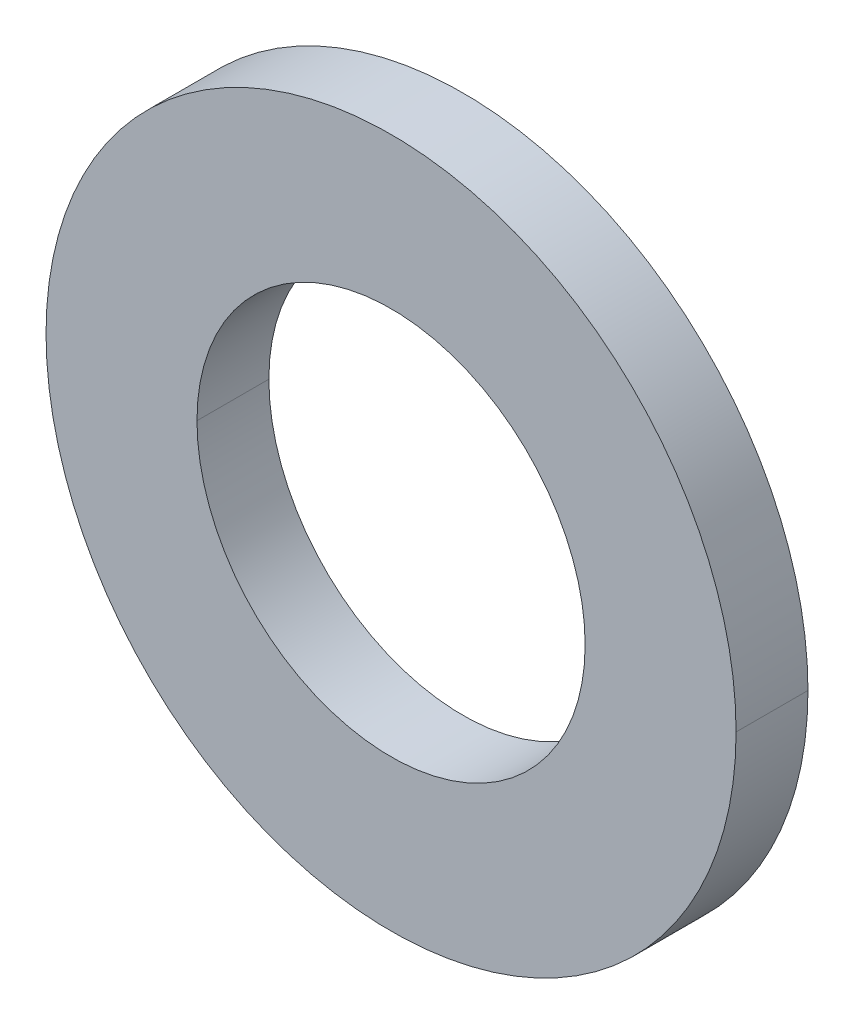
ISO-10303-21;
HEADER;
FILE_DESCRIPTION(('STEP AP214'),'2;1');
FILE_NAME('part.step','',(''),(''),'','','');
FILE_SCHEMA(('AUTOMOTIVE_DESIGN { 1 0 10303 214 1 1 1 1 }'));
ENDSEC;
DATA;
#1=APPLICATION_CONTEXT('core data for automotive mechanical design processes');
#2=APPLICATION_PROTOCOL_DEFINITION('international standard','automotive_design',2000,#1);
#3=PRODUCT_CONTEXT('',#1,'mechanical');
#4=PRODUCT('Part','Part','',(#3));
#5=PRODUCT_RELATED_PRODUCT_CATEGORY('part','',(#4));
#6=PRODUCT_DEFINITION_FORMATION('','',#4);
#7=PRODUCT_DEFINITION_CONTEXT('part definition',#1,'design');
#8=PRODUCT_DEFINITION('design','',#6,#7);
#9=PRODUCT_DEFINITION_SHAPE('','',#8);
#10=(LENGTH_UNIT() NAMED_UNIT(*) SI_UNIT(.MILLI.,.METRE.));
#11=(NAMED_UNIT(*) PLANE_ANGLE_UNIT() SI_UNIT($,.RADIAN.));
#12=(NAMED_UNIT(*) SI_UNIT($,.STERADIAN.) SOLID_ANGLE_UNIT());
#13=UNCERTAINTY_MEASURE_WITH_UNIT(LENGTH_MEASURE(1.E-05),#10,'distance_accuracy_value','');
#14=(GEOMETRIC_REPRESENTATION_CONTEXT(3) GLOBAL_UNCERTAINTY_ASSIGNED_CONTEXT((#13)) GLOBAL_UNIT_ASSIGNED_CONTEXT((#10,
#11,#12)) REPRESENTATION_CONTEXT('',''));
#15=CARTESIAN_POINT('',(0.,0.,0.));
#16=DIRECTION('',(0.,0.,1.));
#17=DIRECTION('',(1.,0.,0.));
#18=AXIS2_PLACEMENT_3D('',#15,#16,#17);
#19=CARTESIAN_POINT('',(0.,0.,-2.5));
#20=DIRECTION('',(0.,0.,1.));
#21=DIRECTION('',(1.,0.,0.));
#22=AXIS2_PLACEMENT_3D('',#19,#20,#21);
#23=CYLINDRICAL_SURFACE('',#22,12.);
#24=DIRECTION('',(0.,0.,1.));
#25=VECTOR('',#24,1.);
#26=CARTESIAN_POINT('',(-12.,0.,-2.5));
#27=LINE('',#26,#25);
#28=CARTESIAN_POINT('',(-12.,0.,-2.5));
#29=VERTEX_POINT('',#28);
#30=CARTESIAN_POINT('',(-12.,0.,0.));
#31=VERTEX_POINT('',#30);
#32=EDGE_CURVE('E39',#29,#31,#27,.T.);
#33=ORIENTED_EDGE('',*,*,#32,.F.);
#34=CARTESIAN_POINT('',(0.,0.,-2.5));
#35=DIRECTION('',(0.,0.,1.));
#36=DIRECTION('',(1.,0.,0.));
#37=AXIS2_PLACEMENT_3D('',#34,#35,#36);
#38=CIRCLE('',#37,12.);
#39=CARTESIAN_POINT('',(12.,0.,-2.5));
#40=VERTEX_POINT('',#39);
#41=EDGE_CURVE('E11',#29,#40,#38,.T.);
#42=ORIENTED_EDGE('',*,*,#41,.T.);
#43=DIRECTION('',(0.,0.,1.));
#44=VECTOR('',#43,1.);
#45=CARTESIAN_POINT('',(12.,0.,-2.5));
#46=LINE('',#45,#44);
#47=CARTESIAN_POINT('',(12.,0.,0.));
#48=VERTEX_POINT('',#47);
#49=EDGE_CURVE('E26',#40,#48,#46,.T.);
#50=ORIENTED_EDGE('',*,*,#49,.T.);
#51=CARTESIAN_POINT('',(0.,0.,0.));
#52=DIRECTION('',(0.,0.,1.));
#53=DIRECTION('',(1.,0.,0.));
#54=AXIS2_PLACEMENT_3D('',#51,#52,#53);
#55=CIRCLE('',#54,12.);
#56=EDGE_CURVE('E77',#31,#48,#55,.T.);
#57=ORIENTED_EDGE('',*,*,#56,.F.);
#58=EDGE_LOOP('',(#33,#42,#50,#57));
#59=FACE_BOUND('',#58,.T.);
#60=ADVANCED_FACE('F16',(#59),#23,.T.);
#61=CARTESIAN_POINT('',(0.,0.,0.));
#62=DIRECTION('',(0.,0.,1.));
#63=DIRECTION('',(1.,0.,0.));
#64=AXIS2_PLACEMENT_3D('',#61,#62,#63);
#65=PLANE('',#64);
#66=CARTESIAN_POINT('',(0.,0.,0.));
#67=DIRECTION('',(0.,0.,1.));
#68=DIRECTION('',(1.,0.,0.));
#69=AXIS2_PLACEMENT_3D('',#66,#67,#68);
#70=CIRCLE('',#69,12.);
#71=EDGE_CURVE('E81',#48,#31,#70,.T.);
#72=ORIENTED_EDGE('',*,*,#71,.T.);
#73=ORIENTED_EDGE('',*,*,#56,.T.);
#74=EDGE_LOOP('',(#72,#73));
#75=FACE_BOUND('',#74,.T.);
#76=CARTESIAN_POINT('',(0.,0.,0.));
#77=DIRECTION('',(0.,0.,1.));
#78=DIRECTION('',(1.,0.,0.));
#79=AXIS2_PLACEMENT_3D('',#76,#77,#78);
#80=CIRCLE('',#79,6.75);
#81=CARTESIAN_POINT('',(6.75,0.,0.));
#82=VERTEX_POINT('',#81);
#83=CARTESIAN_POINT('',(-6.75,0.,0.));
#84=VERTEX_POINT('',#83);
#85=EDGE_CURVE('E99',#82,#84,#80,.T.);
#86=ORIENTED_EDGE('',*,*,#85,.F.);
#87=CARTESIAN_POINT('',(0.,0.,0.));
#88=DIRECTION('',(0.,0.,1.));
#89=DIRECTION('',(1.,0.,0.));
#90=AXIS2_PLACEMENT_3D('',#87,#88,#89);
#91=CIRCLE('',#90,6.75);
#92=EDGE_CURVE('E56',#84,#82,#91,.T.);
#93=ORIENTED_EDGE('',*,*,#92,.F.);
#94=EDGE_LOOP('',(#86,#93));
#95=FACE_BOUND('',#94,.T.);
#96=ADVANCED_FACE('F79',(#75,#95),#65,.T.);
#97=CARTESIAN_POINT('',(0.,0.,-2.5));
#98=DIRECTION('',(0.,0.,1.));
#99=DIRECTION('',(1.,0.,0.));
#100=AXIS2_PLACEMENT_3D('',#97,#98,#99);
#101=CYLINDRICAL_SURFACE('',#100,12.);
#102=CARTESIAN_POINT('',(0.,0.,-2.5));
#103=DIRECTION('',(0.,0.,1.));
#104=DIRECTION('',(1.,0.,0.));
#105=AXIS2_PLACEMENT_3D('',#102,#103,#104);
#106=CIRCLE('',#105,12.);
#107=EDGE_CURVE('E83',#40,#29,#106,.T.);
#108=ORIENTED_EDGE('',*,*,#107,.T.);
#109=ORIENTED_EDGE('',*,*,#32,.T.);
#110=ORIENTED_EDGE('',*,*,#71,.F.);
#111=ORIENTED_EDGE('',*,*,#49,.F.);
#112=EDGE_LOOP('',(#108,#109,#110,#111));
#113=FACE_BOUND('',#112,.T.);
#114=ADVANCED_FACE('F90',(#113),#101,.T.);
#115=CARTESIAN_POINT('',(0.,0.,-2.5));
#116=DIRECTION('',(0.,0.,1.));
#117=DIRECTION('',(1.,0.,0.));
#118=AXIS2_PLACEMENT_3D('',#115,#116,#117);
#119=PLANE('',#118);
#120=ORIENTED_EDGE('',*,*,#107,.F.);
#121=ORIENTED_EDGE('',*,*,#41,.F.);
#122=EDGE_LOOP('',(#120,#121));
#123=FACE_BOUND('',#122,.T.);
#124=CARTESIAN_POINT('',(0.,0.,-2.5));
#125=DIRECTION('',(0.,0.,1.));
#126=DIRECTION('',(1.,0.,0.));
#127=AXIS2_PLACEMENT_3D('',#124,#125,#126);
#128=CIRCLE('',#127,6.75);
#129=CARTESIAN_POINT('',(6.75,0.,-2.5));
#130=VERTEX_POINT('',#129);
#131=CARTESIAN_POINT('',(-6.75,0.,-2.5));
#132=VERTEX_POINT('',#131);
#133=EDGE_CURVE('E102',#130,#132,#128,.T.);
#134=ORIENTED_EDGE('',*,*,#133,.T.);
#135=CARTESIAN_POINT('',(0.,0.,-2.5));
#136=DIRECTION('',(0.,0.,1.));
#137=DIRECTION('',(1.,0.,0.));
#138=AXIS2_PLACEMENT_3D('',#135,#136,#137);
#139=CIRCLE('',#138,6.75);
#140=EDGE_CURVE('E110',#132,#130,#139,.T.);
#141=ORIENTED_EDGE('',*,*,#140,.T.);
#142=EDGE_LOOP('',(#134,#141));
#143=FACE_BOUND('',#142,.T.);
#144=ADVANCED_FACE('F137',(#123,#143),#119,.F.);
#145=CARTESIAN_POINT('',(0.,0.,-2.5));
#146=DIRECTION('',(0.,0.,1.));
#147=DIRECTION('',(1.,0.,0.));
#148=AXIS2_PLACEMENT_3D('',#145,#146,#147);
#149=CYLINDRICAL_SURFACE('',#148,6.75);
#150=DIRECTION('',(0.,0.,1.));
#151=VECTOR('',#150,1.);
#152=CARTESIAN_POINT('',(-6.75,0.,-2.5));
#153=LINE('',#152,#151);
#154=EDGE_CURVE('E97',#132,#84,#153,.T.);
#155=ORIENTED_EDGE('',*,*,#154,.F.);
#156=ORIENTED_EDGE('',*,*,#133,.F.);
#157=DIRECTION('',(0.,0.,1.));
#158=VECTOR('',#157,1.);
#159=CARTESIAN_POINT('',(6.75,0.,-2.5));
#160=LINE('',#159,#158);
#161=EDGE_CURVE('E19',#130,#82,#160,.T.);
#162=ORIENTED_EDGE('',*,*,#161,.T.);
#163=ORIENTED_EDGE('',*,*,#85,.T.);
#164=EDGE_LOOP('',(#155,#156,#162,#163));
#165=FACE_BOUND('',#164,.T.);
#166=ADVANCED_FACE('F128',(#165),#149,.F.);
#167=CARTESIAN_POINT('',(0.,0.,-2.5));
#168=DIRECTION('',(0.,0.,1.));
#169=DIRECTION('',(1.,0.,0.));
#170=AXIS2_PLACEMENT_3D('',#167,#168,#169);
#171=CYLINDRICAL_SURFACE('',#170,6.75);
#172=ORIENTED_EDGE('',*,*,#140,.F.);
#173=ORIENTED_EDGE('',*,*,#154,.T.);
#174=ORIENTED_EDGE('',*,*,#92,.T.);
#175=ORIENTED_EDGE('',*,*,#161,.F.);
#176=EDGE_LOOP('',(#172,#173,#174,#175));
#177=FACE_BOUND('',#176,.T.);
#178=ADVANCED_FACE('F126',(#177),#171,.F.);
#179=CLOSED_SHELL('',(#60,#96,#114,#144,#166,#178));
#180=MANIFOLD_SOLID_BREP('B1',#179);
#181=ADVANCED_BREP_SHAPE_REPRESENTATION('',(#18,#180),#14);
#182=SHAPE_DEFINITION_REPRESENTATION(#9,#181);
ENDSEC;
END-ISO-10303-21;
